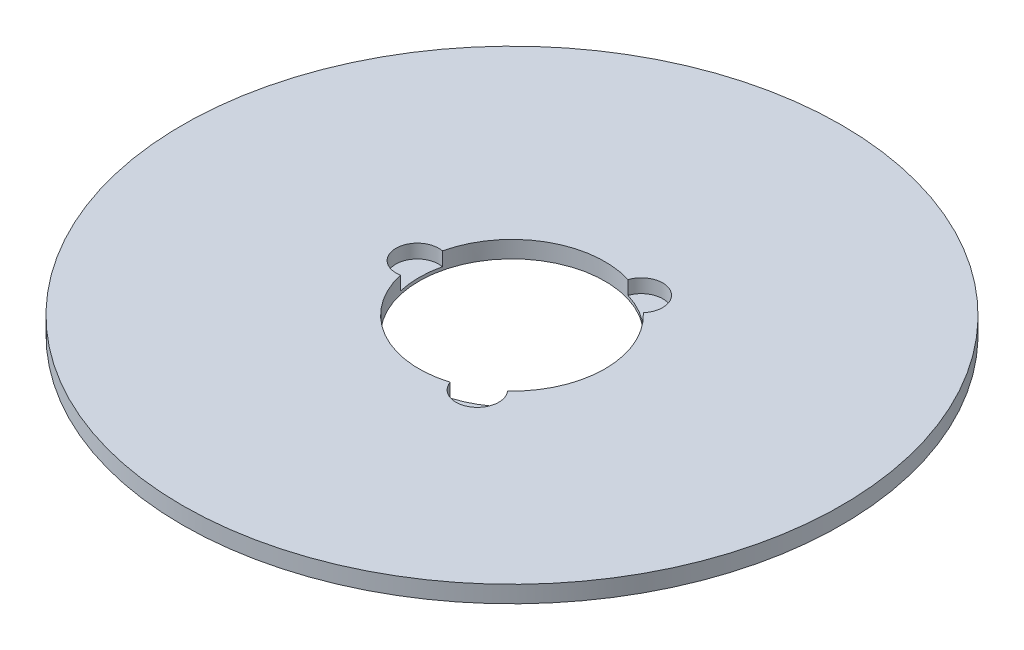
ISO-10303-21;
HEADER;
FILE_DESCRIPTION(('STEP AP214'),'2;1');
FILE_NAME('part.step','',(''),(''),'','','');
FILE_SCHEMA(('AUTOMOTIVE_DESIGN { 1 0 10303 214 1 1 1 1 }'));
ENDSEC;
DATA;
#1=APPLICATION_CONTEXT('core data for automotive mechanical design processes');
#2=APPLICATION_PROTOCOL_DEFINITION('international standard','automotive_design',2000,#1);
#3=PRODUCT_CONTEXT('',#1,'mechanical');
#4=PRODUCT('Part','Part','',(#3));
#5=PRODUCT_RELATED_PRODUCT_CATEGORY('part','',(#4));
#6=PRODUCT_DEFINITION_FORMATION('','',#4);
#7=PRODUCT_DEFINITION_CONTEXT('part definition',#1,'design');
#8=PRODUCT_DEFINITION('design','',#6,#7);
#9=PRODUCT_DEFINITION_SHAPE('','',#8);
#10=(LENGTH_UNIT() NAMED_UNIT(*) SI_UNIT(.MILLI.,.METRE.));
#11=(NAMED_UNIT(*) PLANE_ANGLE_UNIT() SI_UNIT($,.RADIAN.));
#12=(NAMED_UNIT(*) SI_UNIT($,.STERADIAN.) SOLID_ANGLE_UNIT());
#13=UNCERTAINTY_MEASURE_WITH_UNIT(LENGTH_MEASURE(1.E-05),#10,'distance_accuracy_value','');
#14=(GEOMETRIC_REPRESENTATION_CONTEXT(3) GLOBAL_UNCERTAINTY_ASSIGNED_CONTEXT((#13)) GLOBAL_UNIT_ASSIGNED_CONTEXT((#10,
#11,#12)) REPRESENTATION_CONTEXT('',''));
#15=CARTESIAN_POINT('',(0.,0.,0.));
#16=DIRECTION('',(0.,0.,1.));
#17=DIRECTION('',(1.,0.,0.));
#18=AXIS2_PLACEMENT_3D('',#15,#16,#17);
#19=CARTESIAN_POINT('',(0.,5.,0.));
#20=DIRECTION('',(0.,-1.,0.));
#21=DIRECTION('',(0.,0.,-1.));
#22=AXIS2_PLACEMENT_3D('',#19,#20,#21);
#23=CYLINDRICAL_SURFACE('',#22,97.5);
#24=CARTESIAN_POINT('',(0.,5.,0.));
#25=DIRECTION('',(0.,1.,0.));
#26=DIRECTION('',(0.,0.,1.));
#27=AXIS2_PLACEMENT_3D('',#24,#25,#26);
#28=CIRCLE('',#27,97.5);
#29=CARTESIAN_POINT('',(0.,5.,97.5));
#30=VERTEX_POINT('',#29);
#31=EDGE_CURVE('E126',#30,#30,#28,.T.);
#32=ORIENTED_EDGE('',*,*,#31,.F.);
#33=EDGE_LOOP('',(#32));
#34=FACE_BOUND('',#33,.T.);
#35=CARTESIAN_POINT('',(0.,0.,0.));
#36=DIRECTION('',(0.,1.,0.));
#37=DIRECTION('',(0.,0.,1.));
#38=AXIS2_PLACEMENT_3D('',#35,#36,#37);
#39=CIRCLE('',#38,97.5);
#40=CARTESIAN_POINT('',(0.,0.,97.5));
#41=VERTEX_POINT('',#40);
#42=EDGE_CURVE('E124',#41,#41,#39,.T.);
#43=ORIENTED_EDGE('',*,*,#42,.T.);
#44=EDGE_LOOP('',(#43));
#45=FACE_BOUND('',#44,.T.);
#46=ADVANCED_FACE('F39',(#34,#45),#23,.T.);
#47=CARTESIAN_POINT('',(0.,5.,0.));
#48=DIRECTION('',(0.,1.,0.));
#49=DIRECTION('',(0.,0.,1.));
#50=AXIS2_PLACEMENT_3D('',#47,#48,#49);
#51=PLANE('',#50);
#52=CARTESIAN_POINT('',(14.0066195371426,5.,24.2601766806175));
#53=DIRECTION('',(0.,1.,0.));
#54=DIRECTION('',(0.866025403784436,0.,-0.500000000000004));
#55=AXIS2_PLACEMENT_3D('',#52,#53,#54);
#56=CIRCLE('',#55,6.32584754375124);
#57=CARTESIAN_POINT('',(8.02020787084107,5.,26.3044913600035));
#58=VERTEX_POINT('',#57);
#59=CARTESIAN_POINT('',(18.770253815971,5.,20.0979494397818));
#60=VERTEX_POINT('',#59);
#61=EDGE_CURVE('E147',#58,#60,#56,.T.);
#62=ORIENTED_EDGE('',*,*,#61,.F.);
#63=CARTESIAN_POINT('',(0.,5.,0.));
#64=DIRECTION('',(0.,1.,0.));
#65=DIRECTION('',(0.,0.,1.));
#66=AXIS2_PLACEMENT_3D('',#63,#64,#65);
#67=CIRCLE('',#66,27.5);
#68=CARTESIAN_POINT('',(-26.7904616868118,5.,6.2065419202216));
#69=VERTEX_POINT('',#68);
#70=EDGE_CURVE('E118',#69,#58,#67,.T.);
#71=ORIENTED_EDGE('',*,*,#70,.F.);
#72=CARTESIAN_POINT('',(-28.0132390742849,5.,0.));
#73=DIRECTION('',(0.,1.,0.));
#74=DIRECTION('',(0.,0.,1.));
#75=AXIS2_PLACEMENT_3D('',#72,#73,#74);
#76=CIRCLE('',#75,6.32584754375124);
#77=CARTESIAN_POINT('',(-26.7904616868118,5.,-6.2065419202216));
#78=VERTEX_POINT('',#77);
#79=EDGE_CURVE('E113',#78,#69,#76,.T.);
#80=ORIENTED_EDGE('',*,*,#79,.F.);
#81=CARTESIAN_POINT('',(8.02020787084071,5.,-26.3044913600036));
#82=VERTEX_POINT('',#81);
#83=EDGE_CURVE('E106',#82,#78,#67,.T.);
#84=ORIENTED_EDGE('',*,*,#83,.F.);
#85=CARTESIAN_POINT('',(14.0066195371422,5.,-24.2601766806177));
#86=DIRECTION('',(0.,1.,0.));
#87=DIRECTION('',(-0.866025403784443,0.,-0.499999999999992));
#88=AXIS2_PLACEMENT_3D('',#85,#86,#87);
#89=CIRCLE('',#88,6.32584754375124);
#90=CARTESIAN_POINT('',(18.7702538159707,5.,-20.0979494397821));
#91=VERTEX_POINT('',#90);
#92=EDGE_CURVE('E90',#91,#82,#89,.T.);
#93=ORIENTED_EDGE('',*,*,#92,.F.);
#94=EDGE_CURVE('E116',#60,#91,#67,.T.);
#95=ORIENTED_EDGE('',*,*,#94,.F.);
#96=EDGE_LOOP('',(#62,#71,#80,#84,#93,#95));
#97=FACE_BOUND('',#96,.T.);
#98=ORIENTED_EDGE('',*,*,#31,.T.);
#99=EDGE_LOOP('',(#98));
#100=FACE_BOUND('',#99,.T.);
#101=ADVANCED_FACE('F115',(#97,#100),#51,.T.);
#102=CARTESIAN_POINT('',(0.,0.,0.));
#103=DIRECTION('',(0.,1.,0.));
#104=DIRECTION('',(0.,0.,1.));
#105=AXIS2_PLACEMENT_3D('',#102,#103,#104);
#106=PLANE('',#105);
#107=CARTESIAN_POINT('',(0.,0.,0.));
#108=DIRECTION('',(0.,1.,0.));
#109=DIRECTION('',(0.,0.,1.));
#110=AXIS2_PLACEMENT_3D('',#107,#108,#109);
#111=CIRCLE('',#110,27.5);
#112=CARTESIAN_POINT('',(0.,0.,27.5));
#113=VERTEX_POINT('',#112);
#114=EDGE_CURVE('E120',#113,#113,#111,.T.);
#115=ORIENTED_EDGE('',*,*,#114,.T.);
#116=EDGE_LOOP('',(#115));
#117=FACE_BOUND('',#116,.T.);
#118=ORIENTED_EDGE('',*,*,#42,.F.);
#119=EDGE_LOOP('',(#118));
#120=FACE_BOUND('',#119,.T.);
#121=ADVANCED_FACE('F164',(#117,#120),#106,.F.);
#122=CARTESIAN_POINT('',(0.,5.,0.));
#123=DIRECTION('',(0.,-1.,0.));
#124=DIRECTION('',(0.,0.,-1.));
#125=AXIS2_PLACEMENT_3D('',#122,#123,#124);
#126=CYLINDRICAL_SURFACE('',#125,27.5);
#127=DIRECTION('',(0.,1.,0.));
#128=VECTOR('',#127,1.);
#129=CARTESIAN_POINT('',(8.02020787084107,2.9679272407756,26.3044913600035));
#130=LINE('',#129,#128);
#131=CARTESIAN_POINT('',(8.02020787084107,0.935854481551204,26.3044913600035));
#132=VERTEX_POINT('',#131);
#133=EDGE_CURVE('E11',#132,#58,#130,.T.);
#134=ORIENTED_EDGE('',*,*,#133,.F.);
#135=CARTESIAN_POINT('',(0.,0.935854481551204,0.));
#136=DIRECTION('',(0.,1.,0.));
#137=DIRECTION('',(0.,0.,1.));
#138=AXIS2_PLACEMENT_3D('',#135,#136,#137);
#139=CIRCLE('',#138,27.5);
#140=CARTESIAN_POINT('',(18.770253815971,0.935854481551204,20.0979494397818));
#141=VERTEX_POINT('',#140);
#142=EDGE_CURVE('E144',#132,#141,#139,.T.);
#143=ORIENTED_EDGE('',*,*,#142,.T.);
#144=DIRECTION('',(0.,1.,0.));
#145=VECTOR('',#144,1.);
#146=CARTESIAN_POINT('',(18.770253815971,2.9679272407756,20.0979494397819));
#147=LINE('',#146,#145);
#148=EDGE_CURVE('E46',#60,#141,#147,.F.);
#149=ORIENTED_EDGE('',*,*,#148,.F.);
#150=ORIENTED_EDGE('',*,*,#94,.T.);
#151=DIRECTION('',(0.,1.,0.));
#152=VECTOR('',#151,1.);
#153=CARTESIAN_POINT('',(18.7702538159707,2.9679272407756,-20.0979494397821));
#154=LINE('',#153,#152);
#155=CARTESIAN_POINT('',(18.7702538159707,0.935854481551204,-20.0979494397821));
#156=VERTEX_POINT('',#155);
#157=EDGE_CURVE('E92',#156,#91,#154,.T.);
#158=ORIENTED_EDGE('',*,*,#157,.F.);
#159=CARTESIAN_POINT('',(0.,0.935854481551204,0.));
#160=DIRECTION('',(0.,1.,0.));
#161=DIRECTION('',(0.,0.,1.));
#162=AXIS2_PLACEMENT_3D('',#159,#160,#161);
#163=CIRCLE('',#162,27.5);
#164=CARTESIAN_POINT('',(8.02020787084071,0.935854481551204,-26.3044913600036));
#165=VERTEX_POINT('',#164);
#166=EDGE_CURVE('E107',#156,#165,#163,.T.);
#167=ORIENTED_EDGE('',*,*,#166,.T.);
#168=DIRECTION('',(0.,1.,0.));
#169=VECTOR('',#168,1.);
#170=CARTESIAN_POINT('',(8.02020787084071,2.9679272407756,-26.3044913600036));
#171=LINE('',#170,#169);
#172=EDGE_CURVE('E95',#82,#165,#171,.F.);
#173=ORIENTED_EDGE('',*,*,#172,.F.);
#174=ORIENTED_EDGE('',*,*,#83,.T.);
#175=DIRECTION('',(0.,1.,0.));
#176=VECTOR('',#175,1.);
#177=CARTESIAN_POINT('',(-26.7904616868118,2.9679272407756,-6.2065419202216));
#178=LINE('',#177,#176);
#179=CARTESIAN_POINT('',(-26.7904616868118,0.935854481551204,-6.2065419202216));
#180=VERTEX_POINT('',#179);
#181=EDGE_CURVE('E143',#180,#78,#178,.T.);
#182=ORIENTED_EDGE('',*,*,#181,.F.);
#183=CARTESIAN_POINT('',(0.,0.935854481551204,0.));
#184=DIRECTION('',(0.,1.,0.));
#185=DIRECTION('',(0.,0.,1.));
#186=AXIS2_PLACEMENT_3D('',#183,#184,#185);
#187=CIRCLE('',#186,27.5);
#188=CARTESIAN_POINT('',(-26.7904616868118,0.935854481551204,6.2065419202216));
#189=VERTEX_POINT('',#188);
#190=EDGE_CURVE('E132',#180,#189,#187,.T.);
#191=ORIENTED_EDGE('',*,*,#190,.T.);
#192=DIRECTION('',(0.,1.,0.));
#193=VECTOR('',#192,1.);
#194=CARTESIAN_POINT('',(-26.7904616868118,2.9679272407756,6.2065419202216));
#195=LINE('',#194,#193);
#196=EDGE_CURVE('E137',#69,#189,#195,.F.);
#197=ORIENTED_EDGE('',*,*,#196,.F.);
#198=ORIENTED_EDGE('',*,*,#70,.T.);
#199=EDGE_LOOP('',(#134,#143,#149,#150,#158,#167,#173,#174,#182,#191,#197,#198));
#200=FACE_BOUND('',#199,.T.);
#201=ORIENTED_EDGE('',*,*,#114,.F.);
#202=EDGE_LOOP('',(#201));
#203=FACE_BOUND('',#202,.T.);
#204=ADVANCED_FACE('F103',(#200,#203),#126,.F.);
#205=CARTESIAN_POINT('',(-28.0132390742849,0.935854481551204,0.));
#206=DIRECTION('',(0.,1.,0.));
#207=DIRECTION('',(0.,0.,1.));
#208=AXIS2_PLACEMENT_3D('',#205,#206,#207);
#209=CYLINDRICAL_SURFACE('',#208,6.32584754375124);
#210=ORIENTED_EDGE('',*,*,#181,.T.);
#211=ORIENTED_EDGE('',*,*,#79,.T.);
#212=ORIENTED_EDGE('',*,*,#196,.T.);
#213=CARTESIAN_POINT('',(-28.0132390742849,0.935854481551204,0.));
#214=DIRECTION('',(0.,1.,0.));
#215=DIRECTION('',(0.,0.,1.));
#216=AXIS2_PLACEMENT_3D('',#213,#214,#215);
#217=CIRCLE('',#216,6.32584754375124);
#218=EDGE_CURVE('E121',#180,#189,#217,.T.);
#219=ORIENTED_EDGE('',*,*,#218,.F.);
#220=EDGE_LOOP('',(#210,#211,#212,#219));
#221=FACE_BOUND('',#220,.T.);
#222=ADVANCED_FACE('F174',(#221),#209,.F.);
#223=CARTESIAN_POINT('',(-28.0132390742849,0.935854481551204,0.));
#224=DIRECTION('',(0.,1.,0.));
#225=DIRECTION('',(0.,0.,1.));
#226=AXIS2_PLACEMENT_3D('',#223,#224,#225);
#227=PLANE('',#226);
#228=ORIENTED_EDGE('',*,*,#218,.T.);
#229=ORIENTED_EDGE('',*,*,#190,.F.);
#230=EDGE_LOOP('',(#228,#229));
#231=FACE_BOUND('',#230,.T.);
#232=ADVANCED_FACE('F177',(#231),#227,.T.);
#233=CARTESIAN_POINT('',(14.0066195371422,0.935854481551204,-24.2601766806177));
#234=DIRECTION('',(0.,1.,0.));
#235=DIRECTION('',(0.,0.,1.));
#236=AXIS2_PLACEMENT_3D('',#233,#234,#235);
#237=CYLINDRICAL_SURFACE('',#236,6.32584754375124);
#238=ORIENTED_EDGE('',*,*,#157,.T.);
#239=ORIENTED_EDGE('',*,*,#92,.T.);
#240=ORIENTED_EDGE('',*,*,#172,.T.);
#241=CARTESIAN_POINT('',(14.0066195371422,0.935854481551204,-24.2601766806177));
#242=DIRECTION('',(0.,1.,0.));
#243=DIRECTION('',(-0.866025403784443,0.,-0.499999999999992));
#244=AXIS2_PLACEMENT_3D('',#241,#242,#243);
#245=CIRCLE('',#244,6.32584754375124);
#246=EDGE_CURVE('E56',#156,#165,#245,.T.);
#247=ORIENTED_EDGE('',*,*,#246,.F.);
#248=EDGE_LOOP('',(#238,#239,#240,#247));
#249=FACE_BOUND('',#248,.T.);
#250=ADVANCED_FACE('F93',(#249),#237,.F.);
#251=CARTESIAN_POINT('',(14.0066195371422,0.935854481551204,-24.2601766806177));
#252=DIRECTION('',(0.,1.,0.));
#253=DIRECTION('',(-0.866025403784443,0.,-0.499999999999992));
#254=AXIS2_PLACEMENT_3D('',#251,#252,#253);
#255=PLANE('',#254);
#256=ORIENTED_EDGE('',*,*,#246,.T.);
#257=ORIENTED_EDGE('',*,*,#166,.F.);
#258=EDGE_LOOP('',(#256,#257));
#259=FACE_BOUND('',#258,.T.);
#260=ADVANCED_FACE('F160',(#259),#255,.T.);
#261=CARTESIAN_POINT('',(14.0066195371426,0.935854481551204,24.2601766806175));
#262=DIRECTION('',(0.,1.,0.));
#263=DIRECTION('',(0.,0.,1.));
#264=AXIS2_PLACEMENT_3D('',#261,#262,#263);
#265=CYLINDRICAL_SURFACE('',#264,6.32584754375124);
#266=ORIENTED_EDGE('',*,*,#133,.T.);
#267=ORIENTED_EDGE('',*,*,#61,.T.);
#268=ORIENTED_EDGE('',*,*,#148,.T.);
#269=CARTESIAN_POINT('',(14.0066195371426,0.935854481551204,24.2601766806175));
#270=DIRECTION('',(0.,1.,0.));
#271=DIRECTION('',(0.866025403784436,0.,-0.500000000000004));
#272=AXIS2_PLACEMENT_3D('',#269,#270,#271);
#273=CIRCLE('',#272,6.32584754375124);
#274=EDGE_CURVE('E55',#132,#141,#273,.T.);
#275=ORIENTED_EDGE('',*,*,#274,.F.);
#276=EDGE_LOOP('',(#266,#267,#268,#275));
#277=FACE_BOUND('',#276,.T.);
#278=ADVANCED_FACE('F149',(#277),#265,.F.);
#279=CARTESIAN_POINT('',(14.0066195371426,0.935854481551204,24.2601766806175));
#280=DIRECTION('',(0.,1.,0.));
#281=DIRECTION('',(0.866025403784436,0.,-0.500000000000004));
#282=AXIS2_PLACEMENT_3D('',#279,#280,#281);
#283=PLANE('',#282);
#284=ORIENTED_EDGE('',*,*,#274,.T.);
#285=ORIENTED_EDGE('',*,*,#142,.F.);
#286=EDGE_LOOP('',(#284,#285));
#287=FACE_BOUND('',#286,.T.);
#288=ADVANCED_FACE('F151',(#287),#283,.T.);
#289=CLOSED_SHELL('',(#46,#101,#121,#204,#222,#232,#250,#260,#278,#288));
#290=MANIFOLD_SOLID_BREP('B2',#289);
#291=ADVANCED_BREP_SHAPE_REPRESENTATION('',(#18,#290),#14);
#292=SHAPE_DEFINITION_REPRESENTATION(#9,#291);
ENDSEC;
END-ISO-10303-21;
